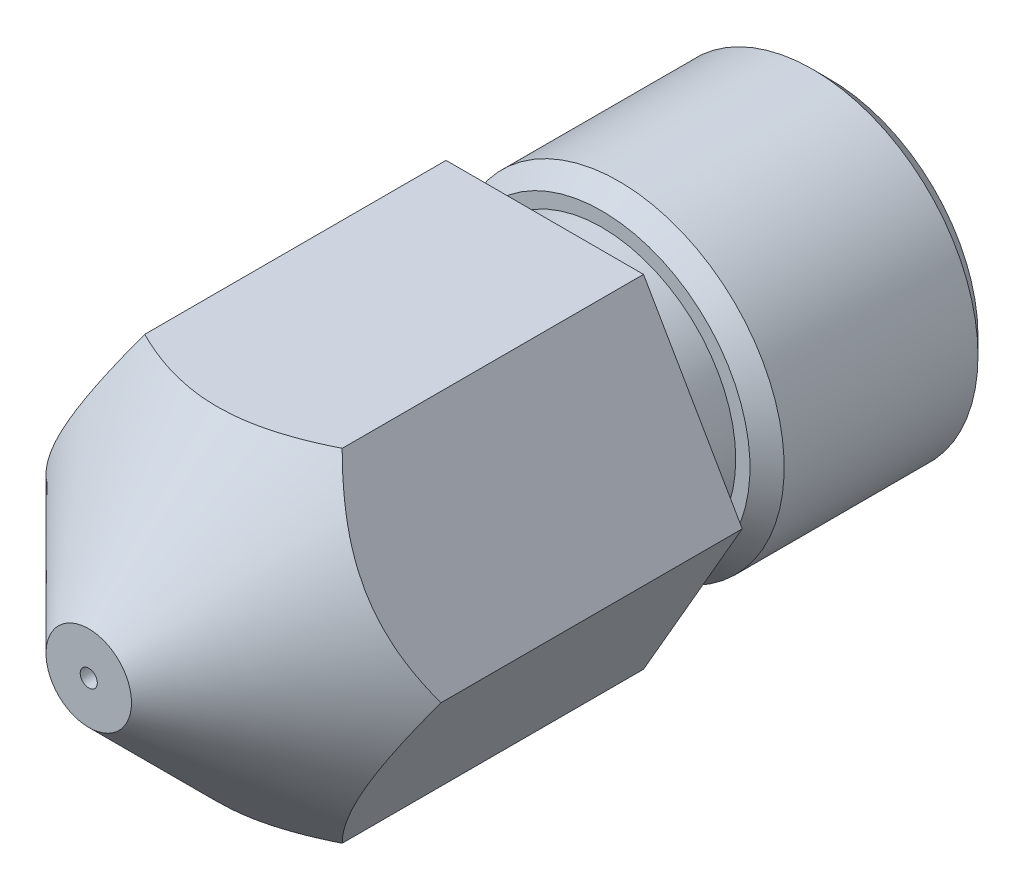
ISO-10303-21;
HEADER;
FILE_DESCRIPTION(('STEP AP214'),'2;1');
FILE_NAME('part.step','',(''),(''),'','','');
FILE_SCHEMA(('AUTOMOTIVE_DESIGN { 1 0 10303 214 1 1 1 1 }'));
ENDSEC;
DATA;
#1=APPLICATION_CONTEXT('core data for automotive mechanical design processes');
#2=APPLICATION_PROTOCOL_DEFINITION('international standard','automotive_design',2000,#1);
#3=PRODUCT_CONTEXT('',#1,'mechanical');
#4=PRODUCT('Part','Part','',(#3));
#5=PRODUCT_RELATED_PRODUCT_CATEGORY('part','',(#4));
#6=PRODUCT_DEFINITION_FORMATION('','',#4);
#7=PRODUCT_DEFINITION_CONTEXT('part definition',#1,'design');
#8=PRODUCT_DEFINITION('design','',#6,#7);
#9=PRODUCT_DEFINITION_SHAPE('','',#8);
#10=(LENGTH_UNIT() NAMED_UNIT(*) SI_UNIT(.MILLI.,.METRE.));
#11=(NAMED_UNIT(*) PLANE_ANGLE_UNIT() SI_UNIT($,.RADIAN.));
#12=(NAMED_UNIT(*) SI_UNIT($,.STERADIAN.) SOLID_ANGLE_UNIT());
#13=UNCERTAINTY_MEASURE_WITH_UNIT(LENGTH_MEASURE(1.E-05),#10,'distance_accuracy_value','');
#14=(GEOMETRIC_REPRESENTATION_CONTEXT(3) GLOBAL_UNCERTAINTY_ASSIGNED_CONTEXT((#13)) GLOBAL_UNIT_ASSIGNED_CONTEXT((#10,
#11,#12)) REPRESENTATION_CONTEXT('',''));
#15=CARTESIAN_POINT('',(0.,0.,0.));
#16=DIRECTION('',(0.,0.,1.));
#17=DIRECTION('',(1.,0.,0.));
#18=AXIS2_PLACEMENT_3D('',#15,#16,#17);
#19=CARTESIAN_POINT('',(0.,0.,5.));
#20=DIRECTION('',(0.,0.,-1.));
#21=DIRECTION('',(-1.,0.,0.));
#22=AXIS2_PLACEMENT_3D('',#19,#20,#21);
#23=CYLINDRICAL_SURFACE('',#22,2.35);
#24=CARTESIAN_POINT('',(0.,0.,5.));
#25=DIRECTION('',(0.,0.,-1.));
#26=DIRECTION('',(-1.,0.,0.));
#27=AXIS2_PLACEMENT_3D('',#24,#25,#26);
#28=CIRCLE('',#27,2.35);
#29=CARTESIAN_POINT('',(-2.35,0.,5.));
#30=VERTEX_POINT('',#29);
#31=EDGE_CURVE('E106',#30,#30,#28,.T.);
#32=ORIENTED_EDGE('',*,*,#31,.T.);
#33=EDGE_LOOP('',(#32));
#34=FACE_BOUND('',#33,.T.);
#35=CARTESIAN_POINT('',(0.,0.,4.));
#36=DIRECTION('',(0.,0.,-1.));
#37=DIRECTION('',(-1.,0.,0.));
#38=AXIS2_PLACEMENT_3D('',#35,#36,#37);
#39=CIRCLE('',#38,2.35);
#40=CARTESIAN_POINT('',(-2.35,0.,4.));
#41=VERTEX_POINT('',#40);
#42=EDGE_CURVE('E259',#41,#41,#39,.T.);
#43=ORIENTED_EDGE('',*,*,#42,.F.);
#44=EDGE_LOOP('',(#43));
#45=FACE_BOUND('',#44,.T.);
#46=ADVANCED_FACE('F36',(#34,#45),#23,.T.);
#47=CARTESIAN_POINT('',(1.73205080756888,-3.00000000000001,13.));
#48=DIRECTION('',(-0.866025403784438,0.5,0.));
#49=DIRECTION('',(-0.5,-0.866025403784439,0.));
#50=AXIS2_PLACEMENT_3D('',#47,#48,#49);
#51=PLANE('',#50);
#52=DIRECTION('',(-0.5,-0.866025403784439,0.));
#53=VECTOR('',#52,1.);
#54=CARTESIAN_POINT('',(1.73205080756888,-3.00000000000001,5.));
#55=LINE('',#54,#53);
#56=CARTESIAN_POINT('',(3.46410161513776,0.,5.));
#57=VERTEX_POINT('',#56);
#58=CARTESIAN_POINT('',(1.73205080756888,-3.00000000000001,5.));
#59=VERTEX_POINT('',#58);
#60=EDGE_CURVE('E51',#57,#59,#55,.T.);
#61=ORIENTED_EDGE('',*,*,#60,.F.);
#62=DIRECTION('',(0.,0.,-1.));
#63=VECTOR('',#62,1.);
#64=CARTESIAN_POINT('',(3.46410161513776,0.,13.));
#65=LINE('',#64,#63);
#66=CARTESIAN_POINT('',(3.46410161513776,0.,10.2858983848622));
#67=VERTEX_POINT('',#66);
#68=EDGE_CURVE('E96',#67,#57,#65,.T.);
#69=ORIENTED_EDGE('',*,*,#68,.F.);
#70=CARTESIAN_POINT('',(1.73193533751504,-3.00020000000001,10.2857829090351));
#71=CARTESIAN_POINT('',(1.79147372663452,-2.89707648504426,10.3452700665405));
#72=CARTESIAN_POINT('',(1.85200767512883,-2.79222861066936,10.4012634053967));
#73=CARTESIAN_POINT('',(1.97544301635334,-2.57843232821891,10.5037857884833));
#74=CARTESIAN_POINT('',(2.03835614749388,-2.46946358862025,10.550257791121));
#75=CARTESIAN_POINT('',(2.16521745390422,-2.24973336040298,10.6298651963459));
#76=CARTESIAN_POINT('',(2.22913332270057,-2.13902782823779,10.6632006842196));
#77=CARTESIAN_POINT('',(2.35837216363117,-1.91517958943468,10.7145608408829));
#78=CARTESIAN_POINT('',(2.42369118784644,-1.80204372079301,10.7326238473266));
#79=CARTESIAN_POINT('',(2.53626564359199,-1.6070590438073,10.7489214764118));
#80=CARTESIAN_POINT('',(2.58337569224233,-1.52546204599787,10.7513340176884));
#81=CARTESIAN_POINT('',(2.67751916315866,-1.36240077116991,10.7472689502051));
#82=CARTESIAN_POINT('',(2.7245525527757,-1.28093655070101,10.7407882248339));
#83=CARTESIAN_POINT('',(2.81817374583238,-1.11877988766163,10.719306662347));
#84=CARTESIAN_POINT('',(2.86476099147975,-1.0380884112157,10.704296294895));
#85=CARTESIAN_POINT('',(2.95713536549225,-0.878091302108665,10.6665747387962));
#86=CARTESIAN_POINT('',(3.00292255491615,-0.798785563690704,10.6438641405394));
#87=CARTESIAN_POINT('',(3.08420868340511,-0.657993859197246,10.5971377000083));
#88=CARTESIAN_POINT('',(3.11988753362892,-0.596196277853974,10.5743500571814));
#89=CARTESIAN_POINT('',(3.19060468282509,-0.47371058247978,10.5251020988048));
#90=CARTESIAN_POINT('',(3.2256429622163,-0.413022502364396,10.4986416711961));
#91=CARTESIAN_POINT('',(3.29496858432308,-0.292947002609137,10.4426413904709));
#92=CARTESIAN_POINT('',(3.32925789884291,-0.233556167704082,10.4131112203839));
#93=CARTESIAN_POINT('',(3.39720147685869,-0.115874438532732,10.3513592932867));
#94=CARTESIAN_POINT('',(3.43085611477447,-0.0575828957522659,10.3191391882029));
#95=CARTESIAN_POINT('',(3.4642170851916,0.000199999999999825,10.2857829090351));
#96=B_SPLINE_CURVE_WITH_KNOTS('',3,(#70,#71,#72,#73,#74,#75,#76,#77,#78,#79,#80,#81,#82,#83,#84,
#85,#86,#87,#88,#89,#90,#91,#92,#93,#94,#95),.UNSPECIFIED.,.F.,.F.,(4,2,2,2,2,2,2,2,2,2,2,2,4),
(0.,0.399603557139309,0.801535286397851,1.19708369162344,1.59163620080174,1.87398941755846,
2.15644160919094,2.43921001247427,2.72195674032139,2.94657516661928,3.17120044767276,
3.39513752837812,3.6189380838074),.UNSPECIFIED.);
#97=CARTESIAN_POINT('',(1.73205080756888,-3.00000000000001,10.2858983848622));
#98=VERTEX_POINT('',#97);
#99=EDGE_CURVE('E114',#98,#67,#96,.T.);
#100=ORIENTED_EDGE('',*,*,#99,.F.);
#101=DIRECTION('',(0.,0.,-1.));
#102=VECTOR('',#101,1.);
#103=CARTESIAN_POINT('',(1.73205080756888,-3.00000000000001,13.));
#104=LINE('',#103,#102);
#105=EDGE_CURVE('E110',#98,#59,#104,.T.);
#106=ORIENTED_EDGE('',*,*,#105,.T.);
#107=EDGE_LOOP('',(#61,#69,#100,#106));
#108=FACE_BOUND('',#107,.T.);
#109=ADVANCED_FACE('F155',(#108),#51,.F.);
#110=CARTESIAN_POINT('',(3.46410161513776,0.,13.));
#111=DIRECTION('',(-0.866025403784438,-0.5,0.));
#112=DIRECTION('',(0.5,-0.866025403784438,0.));
#113=AXIS2_PLACEMENT_3D('',#110,#111,#112);
#114=PLANE('',#113);
#115=DIRECTION('',(0.5,-0.866025403784438,0.));
#116=VECTOR('',#115,1.);
#117=CARTESIAN_POINT('',(3.46410161513776,0.,5.));
#118=LINE('',#117,#116);
#119=CARTESIAN_POINT('',(1.73205080756887,3.00000000000002,5.));
#120=VERTEX_POINT('',#119);
#121=EDGE_CURVE('E232',#120,#57,#118,.T.);
#122=ORIENTED_EDGE('',*,*,#121,.F.);
#123=DIRECTION('',(0.,0.,-1.));
#124=VECTOR('',#123,1.);
#125=CARTESIAN_POINT('',(1.73205080756887,3.00000000000002,13.));
#126=LINE('',#125,#124);
#127=CARTESIAN_POINT('',(1.73205080756887,3.00000000000002,10.2858983848622));
#128=VERTEX_POINT('',#127);
#129=EDGE_CURVE('E120',#128,#120,#126,.T.);
#130=ORIENTED_EDGE('',*,*,#129,.F.);
#131=CARTESIAN_POINT('',(3.4642170851916,-0.0002,10.2857829090351));
#132=CARTESIAN_POINT('',(3.40467869607212,0.102923514955748,10.3452700665405));
#133=CARTESIAN_POINT('',(3.34414474757781,0.20777138933065,10.4012634053967));
#134=CARTESIAN_POINT('',(3.2207094063533,0.421567671781097,10.5037857884833));
#135=CARTESIAN_POINT('',(3.15779627521276,0.530536411379761,10.550257791121));
#136=CARTESIAN_POINT('',(3.03093496880242,0.750266639597031,10.6298651963459));
#137=CARTESIAN_POINT('',(2.96701910000607,0.860972171762214,10.6632006842196));
#138=CARTESIAN_POINT('',(2.83778025907547,1.08482041056533,10.7145608408829));
#139=CARTESIAN_POINT('',(2.7724612348602,1.197956279207,10.7326238473266));
#140=CARTESIAN_POINT('',(2.65988677911465,1.39294095619271,10.7489214764118));
#141=CARTESIAN_POINT('',(2.6127767304643,1.47453795400214,10.7513340176884));
#142=CARTESIAN_POINT('',(2.51863325954798,1.63759922883009,10.7472689502051));
#143=CARTESIAN_POINT('',(2.47159986993094,1.71906344929899,10.7407882248339));
#144=CARTESIAN_POINT('',(2.37797867687426,1.88122011233838,10.719306662347));
#145=CARTESIAN_POINT('',(2.33139143122689,1.96191158878431,10.704296294895));
#146=CARTESIAN_POINT('',(2.23901705721438,2.12190869789134,10.6665747387962));
#147=CARTESIAN_POINT('',(2.19322986779049,2.2012144363093,10.6438641405394));
#148=CARTESIAN_POINT('',(2.11194373930153,2.34200614080276,10.5971377000083));
#149=CARTESIAN_POINT('',(2.07626488907772,2.40380372214604,10.5743500571814));
#150=CARTESIAN_POINT('',(2.00554773988155,2.52628941752023,10.5251020988048));
#151=CARTESIAN_POINT('',(1.97050946049033,2.58697749763562,10.498641671196));
#152=CARTESIAN_POINT('',(1.90118383838355,2.70705299739088,10.4426413904709));
#153=CARTESIAN_POINT('',(1.86689452386372,2.76644383229594,10.4131112203839));
#154=CARTESIAN_POINT('',(1.79895094584794,2.88412556146729,10.3513592932867));
#155=CARTESIAN_POINT('',(1.76529630793216,2.94241710424776,10.3191391882029));
#156=CARTESIAN_POINT('',(1.73193533751503,3.00020000000002,10.2857829090351));
#157=B_SPLINE_CURVE_WITH_KNOTS('',3,(#131,#132,#133,#134,#135,#136,#137,#138,#139,#140,#141,
#142,#143,#144,#145,#146,#147,#148,#149,#150,#151,#152,#153,#154,#155,#156),.UNSPECIFIED.,.F.,
.F.,(4,2,2,2,2,2,2,2,2,2,2,2,4),(0.,0.399603557139307,0.801535286397847,1.19708369162343,
1.59163620080173,1.87398941755845,2.15644160919093,2.43921001247426,2.72195674032139,
2.94657516661928,3.17120044767276,3.39513752837813,3.61893808380742),.UNSPECIFIED.);
#158=EDGE_CURVE('E213',#67,#128,#157,.T.);
#159=ORIENTED_EDGE('',*,*,#158,.F.);
#160=ORIENTED_EDGE('',*,*,#68,.T.);
#161=EDGE_LOOP('',(#122,#130,#159,#160));
#162=FACE_BOUND('',#161,.T.);
#163=ADVANCED_FACE('F161',(#162),#114,.F.);
#164=CARTESIAN_POINT('',(1.73205080756887,3.00000000000002,13.));
#165=DIRECTION('',(0.,-1.,0.));
#166=DIRECTION('',(0.,0.,-1.));
#167=AXIS2_PLACEMENT_3D('',#164,#165,#166);
#168=PLANE('',#167);
#169=DIRECTION('',(1.,0.,0.));
#170=VECTOR('',#169,1.);
#171=CARTESIAN_POINT('',(1.73205080756887,3.00000000000002,5.));
#172=LINE('',#171,#170);
#173=CARTESIAN_POINT('',(-1.73205080756888,3.00000000000002,5.));
#174=VERTEX_POINT('',#173);
#175=EDGE_CURVE('E235',#174,#120,#172,.T.);
#176=ORIENTED_EDGE('',*,*,#175,.F.);
#177=DIRECTION('',(0.,0.,-1.));
#178=VECTOR('',#177,1.);
#179=CARTESIAN_POINT('',(-1.73205080756888,3.00000000000002,13.));
#180=LINE('',#179,#178);
#181=CARTESIAN_POINT('',(-1.73205080756888,3.00000000000002,10.2858983848622));
#182=VERTEX_POINT('',#181);
#183=EDGE_CURVE('E112',#182,#174,#180,.T.);
#184=ORIENTED_EDGE('',*,*,#183,.F.);
#185=CARTESIAN_POINT('',(-10.8297485442238,3.00000000000002,2.5124089088846));
#186=CARTESIAN_POINT('',(-10.554255001337,3.00000000000002,2.77787972128063));
#187=CARTESIAN_POINT('',(-10.2784230341861,3.00000000000002,3.04300107978719));
#188=CARTESIAN_POINT('',(-9.7258325920714,3.00000000000002,3.57230971653583));
#189=CARTESIAN_POINT('',(-9.44907406205973,3.00000000000002,3.8364969372916));
#190=CARTESIAN_POINT('',(-8.89359643316114,3.00000000000002,4.36444710209984));
#191=CARTESIAN_POINT('',(-8.61487395960892,3.00000000000002,4.62820649859936));
#192=CARTESIAN_POINT('',(-8.05593967816077,3.00000000000002,5.15411793874028));
#193=CARTESIAN_POINT('',(-7.77572794094905,3.00000000000002,5.41627005741751));
#194=CARTESIAN_POINT('',(-7.178698325912,3.00000000000002,5.97054614237296));
#195=CARTESIAN_POINT('',(-6.86161890712889,3.00000000000002,6.26238874099486));
#196=CARTESIAN_POINT('',(-6.22381001221929,3.00000000000002,6.84217969394711));
#197=CARTESIAN_POINT('',(-5.90307997232285,3.00000000000002,7.13012743134141));
#198=CARTESIAN_POINT('',(-5.41818186961389,3.00000000000002,7.55718701315483));
#199=CARTESIAN_POINT('',(-5.2560533810813,3.00000000000002,7.69861287584137));
#200=CARTESIAN_POINT('',(-4.93008853106337,3.00000000000002,7.97948004218076));
#201=CARTESIAN_POINT('',(-4.76625220708876,3.00000000000002,8.11892138926286));
#202=CARTESIAN_POINT('',(-4.4364553305928,3.00000000000002,8.39518647476797));
#203=CARTESIAN_POINT('',(-4.27049534066076,3.00000000000002,8.53201088343815));
#204=CARTESIAN_POINT('',(-3.9357929900219,3.00000000000002,8.8022049280608));
#205=CARTESIAN_POINT('',(-3.76705086581556,3.00000000000002,8.93557485521509));
#206=CARTESIAN_POINT('',(-3.49824586120017,3.00000000000002,9.14198638611179));
#207=CARTESIAN_POINT('',(-3.39940876121794,3.00000000000002,9.21662339846001));
#208=CARTESIAN_POINT('',(-3.20029037669613,3.00000000000002,9.36395797092366));
#209=CARTESIAN_POINT('',(-3.10000904674469,3.00000000000002,9.4366554698478));
#210=CARTESIAN_POINT('',(-2.89758424783018,3.00000000000002,9.57976478384178));
#211=CARTESIAN_POINT('',(-2.79543807657385,3.00000000000002,9.65017278901778));
#212=CARTESIAN_POINT('',(-2.58912631607286,3.00000000000002,9.78797049570078));
#213=CARTESIAN_POINT('',(-2.48496080655522,3.00000000000002,9.85536031602468));
#214=CARTESIAN_POINT('',(-2.27613862552415,3.00000000000002,9.98513149775432));
#215=CARTESIAN_POINT('',(-2.17152470649404,3.00000000000002,10.0475812755354));
#216=CARTESIAN_POINT('',(-1.95957749878952,3.00000000000002,10.1677769743196));
#217=CARTESIAN_POINT('',(-1.85224363144994,3.00000000000002,10.225521883165));
#218=CARTESIAN_POINT('',(-1.63477381605771,3.00000000000002,10.3347885975086));
#219=CARTESIAN_POINT('',(-1.52464585932391,3.00000000000002,10.3863261580441));
#220=CARTESIAN_POINT('',(-1.30108726305077,3.00000000000002,10.4815725414289));
#221=CARTESIAN_POINT('',(-1.18765894719354,3.00000000000002,10.5252867245004));
#222=CARTESIAN_POINT('',(-0.980811658962299,3.00000000000002,10.594918873984));
#223=CARTESIAN_POINT('',(-0.888006801669923,3.00000000000002,10.6226480576432));
#224=CARTESIAN_POINT('',(-0.700458325163697,3.00000000000002,10.6706441632019));
#225=CARTESIAN_POINT('',(-0.605714742527311,3.00000000000002,10.6909112257507));
#226=CARTESIAN_POINT('',(-0.41529528385232,3.00000000000002,10.7228369617959));
#227=CARTESIAN_POINT('',(-0.319627282458229,3.00000000000002,10.7345418615844));
#228=CARTESIAN_POINT('',(-0.127606442156774,3.00000000000002,10.7488130596983));
#229=CARTESIAN_POINT('',(-0.0312536608819576,3.00000000000002,10.7513801181679));
#230=CARTESIAN_POINT('',(0.15895275580178,3.00000000000002,10.7472615358332));
#231=CARTESIAN_POINT('',(0.252811285760117,3.00000000000002,10.7407946860341));
#232=CARTESIAN_POINT('',(0.439547373352868,3.00000000000002,10.7193907048937));
#233=CARTESIAN_POINT('',(0.532424867801881,3.00000000000002,10.7044530313213));
#234=CARTESIAN_POINT('',(0.717111364718103,3.00000000000002,10.666816230935));
#235=CARTESIAN_POINT('',(0.80891148471331,3.00000000000002,10.6440741578579));
#236=CARTESIAN_POINT('',(0.990567448412205,3.00000000000002,10.591891644603));
#237=CARTESIAN_POINT('',(1.08042316309858,3.00000000000002,10.5624507614217));
#238=CARTESIAN_POINT('',(1.27162989432501,3.00000000000002,10.4930172631227));
#239=CARTESIAN_POINT('',(1.37264248392279,3.00000000000002,10.4521000206105));
#240=CARTESIAN_POINT('',(1.57202758706782,3.00000000000002,10.3642571236486));
#241=CARTESIAN_POINT('',(1.6703991954134,3.00000000000002,10.3173294401244));
#242=CARTESIAN_POINT('',(1.86487326297797,3.00000000000002,10.2186091490727));
#243=CARTESIAN_POINT('',(1.96097133622215,3.00000000000002,10.1668079675588));
#244=CARTESIAN_POINT('',(2.15097733592296,3.00000000000002,10.0593950954247));
#245=CARTESIAN_POINT('',(2.24488564330471,3.00000000000002,10.0037840742819));
#246=CARTESIAN_POINT('',(2.43204312152552,3.00000000000002,9.88874185394323));
#247=CARTESIAN_POINT('',(2.52526705470782,3.00000000000002,9.8292697876902));
#248=CARTESIAN_POINT('',(2.71004273833082,3.00000000000002,9.70778674722998));
#249=CARTESIAN_POINT('',(2.80159444303175,3.00000000000002,9.64577570372517));
#250=CARTESIAN_POINT('',(2.98316159349321,3.00000000000002,9.51975356320487));
#251=CARTESIAN_POINT('',(3.07317857826379,3.00000000000002,9.45574467729168));
#252=CARTESIAN_POINT('',(3.2519703453001,3.00000000000002,9.32602678136143));
#253=CARTESIAN_POINT('',(3.34074517510076,3.00000000000002,9.26031783667809));
#254=CARTESIAN_POINT('',(3.63631010806832,3.00000000000002,9.03788714348272));
#255=CARTESIAN_POINT('',(3.84071277943037,3.00000000000002,8.87799296098379));
#256=CARTESIAN_POINT('',(4.24536205671539,3.00000000000002,8.55301472303176));
#257=CARTESIAN_POINT('',(4.4456079883072,3.00000000000002,8.3879298362678));
#258=CARTESIAN_POINT('',(4.84311201861056,3.00000000000002,8.05402696552772));
#259=CARTESIAN_POINT('',(5.04036870580595,3.00000000000002,7.88520730519728));
#260=CARTESIAN_POINT('',(5.43256640459198,3.00000000000002,7.54489750781877));
#261=CARTESIAN_POINT('',(5.62750735649585,3.00000000000002,7.37340730220104));
#262=CARTESIAN_POINT('',(6.01602548386374,3.00000000000002,7.02804861909296));
#263=CARTESIAN_POINT('',(6.2095987863833,3.00000000000002,6.85417579154342));
#264=CARTESIAN_POINT('',(6.59533979089241,3.00000000000002,6.50487473650004));
#265=CARTESIAN_POINT('',(6.78750747293426,3.00000000000002,6.32944648701048));
#266=CARTESIAN_POINT('',(7.36223279304592,3.00000000000002,5.80145273009404));
#267=CARTESIAN_POINT('',(7.743126218278,3.00000000000002,5.44707654023067));
#268=CARTESIAN_POINT('',(8.4574939360397,3.00000000000002,4.77693402748768));
#269=CARTESIAN_POINT('',(8.79129232051,3.00000000000002,4.46151191740662));
#270=CARTESIAN_POINT('',(9.45724371903641,3.00000000000002,3.82887935215163));
#271=CARTESIAN_POINT('',(9.78939659045885,3.00000000000002,3.51166874687485));
#272=CARTESIAN_POINT('',(10.4511752285513,3.00000000000002,2.87717904452788));
#273=CARTESIAN_POINT('',(10.7808058006566,3.00000000000002,2.55990495384235));
#274=CARTESIAN_POINT('',(11.4390685849662,3.00000000000002,1.92438698279263));
#275=CARTESIAN_POINT('',(11.7677008918935,3.00000000000002,1.6061432005698));
#276=CARTESIAN_POINT('',(12.0959850288915,3.00000000000002,1.28754222397662));
#277=B_SPLINE_CURVE_WITH_KNOTS('',3,(#185,#186,#187,#188,#189,#190,#191,#192,#193,#194,#195,
#196,#197,#198,#199,#200,#201,#202,#203,#204,#205,#206,#207,#208,#209,#210,#211,#212,#213,#214,
#215,#216,#217,#218,#219,#220,#221,#222,#223,#224,#225,#226,#227,#228,#229,#230,#231,#232,#233,
#234,#235,#236,#237,#238,#239,#240,#241,#242,#243,#244,#245,#246,#247,#248,#249,#250,#251,#252,
#253,#254,#255,#256,#257,#258,#259,#260,#261,#262,#263,#264,#265,#266,#267,#268,#269,#270,#271,
#272,#273,#274,#275,#276),.UNSPECIFIED.,.F.,.F.,(4,2,2,2,2,2,2,2,2,2,2,2,2,2,2,2,2,2,2,2,2,2,2,
2,2,2,2,2,2,2,2,2,2,2,2,2,2,2,2,2,2,2,2,2,2,4),(0.,1.14775715410339,2.29558375231578,
3.44679461375312,4.59795131525612,5.89076048059842,7.18377208051808,7.82919233662477,
8.47459844652932,9.1198369802961,9.76502094430699,10.1365602695831,10.5081113030283,
10.8802519023127,11.2523778386369,11.6177913122069,11.9832831906984,12.3478269299939,
12.7121199362336,13.0024370688299,13.292748729124,13.5814812175134,13.8701896867257,
14.1520259189822,14.4338801940735,14.7173110185695,15.0007605922656,15.3274674453842,
15.6542848841509,15.9816884487522,16.309034627784,16.6407199446259,16.9724143203703,
17.3037537755725,17.6350805161659,18.4134693001945,19.1919833875399,19.9708543005205,
20.7497452450898,21.5303248291057,22.3109154692076,23.8716396168165,25.2493895260677,
26.6272568398787,27.9997970018826,29.3722025819775),.UNSPECIFIED.);
#278=EDGE_CURVE('E208',#128,#182,#277,.F.);
#279=ORIENTED_EDGE('',*,*,#278,.F.);
#280=ORIENTED_EDGE('',*,*,#129,.T.);
#281=EDGE_LOOP('',(#176,#184,#279,#280));
#282=FACE_BOUND('',#281,.T.);
#283=ADVANCED_FACE('F218',(#282),#168,.F.);
#284=CARTESIAN_POINT('',(-1.73205080756888,3.00000000000002,13.));
#285=DIRECTION('',(0.866025403784438,-0.500000000000001,0.));
#286=DIRECTION('',(0.500000000000001,0.866025403784438,0.));
#287=AXIS2_PLACEMENT_3D('',#284,#285,#286);
#288=PLANE('',#287);
#289=DIRECTION('',(0.500000000000001,0.866025403784438,0.));
#290=VECTOR('',#289,1.);
#291=CARTESIAN_POINT('',(-1.73205080756888,3.00000000000002,5.));
#292=LINE('',#291,#290);
#293=CARTESIAN_POINT('',(-3.46410161513777,0.,5.));
#294=VERTEX_POINT('',#293);
#295=EDGE_CURVE('E105',#294,#174,#292,.T.);
#296=ORIENTED_EDGE('',*,*,#295,.F.);
#297=DIRECTION('',(0.,0.,-1.));
#298=VECTOR('',#297,1.);
#299=CARTESIAN_POINT('',(-3.46410161513777,0.,13.));
#300=LINE('',#299,#298);
#301=CARTESIAN_POINT('',(-3.46410161513777,0.,10.2858983848622));
#302=VERTEX_POINT('',#301);
#303=EDGE_CURVE('E104',#302,#294,#300,.T.);
#304=ORIENTED_EDGE('',*,*,#303,.F.);
#305=CARTESIAN_POINT('',(-1.73193533751504,3.00020000000002,10.2857829090351));
#306=CARTESIAN_POINT('',(-1.79147372663452,2.89707648504427,10.3452700665404));
#307=CARTESIAN_POINT('',(-1.85200767512883,2.79222861066937,10.4012634053967));
#308=CARTESIAN_POINT('',(-1.97544301635334,2.57843232821892,10.5037857884833));
#309=CARTESIAN_POINT('',(-2.03835614749389,2.46946358862026,10.5502577911209));
#310=CARTESIAN_POINT('',(-2.16521745390423,2.24973336040299,10.6298651963459));
#311=CARTESIAN_POINT('',(-2.22913332270057,2.1390278282378,10.6632006842196));
#312=CARTESIAN_POINT('',(-2.35837216363118,1.91517958943469,10.7145608408829));
#313=CARTESIAN_POINT('',(-2.42369118784645,1.80204372079302,10.7326238473266));
#314=CARTESIAN_POINT('',(-2.536265643592,1.60705904380731,10.7489214764117));
#315=CARTESIAN_POINT('',(-2.58337569224234,1.52546204599787,10.7513340176884));
#316=CARTESIAN_POINT('',(-2.67751916315867,1.36240077116992,10.7472689502051));
#317=CARTESIAN_POINT('',(-2.72455255277571,1.28093655070102,10.7407882248339));
#318=CARTESIAN_POINT('',(-2.81817374583239,1.11877988766163,10.719306662347));
#319=CARTESIAN_POINT('',(-2.86476099147976,1.0380884112157,10.704296294895));
#320=CARTESIAN_POINT('',(-2.95713536549226,0.878091302108668,10.6665747387962));
#321=CARTESIAN_POINT('',(-3.00292255491616,0.798785563690707,10.6438641405394));
#322=CARTESIAN_POINT('',(-3.08420868340512,0.657993859197249,10.5971377000083));
#323=CARTESIAN_POINT('',(-3.11988753362893,0.596196277853977,10.5743500571814));
#324=CARTESIAN_POINT('',(-3.1906046828251,0.473710582479783,10.5251020988048));
#325=CARTESIAN_POINT('',(-3.22564296221631,0.413022502364399,10.498641671196));
#326=CARTESIAN_POINT('',(-3.29496858432309,0.29294700260914,10.4426413904709));
#327=CARTESIAN_POINT('',(-3.32925789884292,0.233556167704085,10.4131112203839));
#328=CARTESIAN_POINT('',(-3.3972014768587,0.115874438532735,10.3513592932867));
#329=CARTESIAN_POINT('',(-3.43085611477448,0.0575828957522694,10.3191391882029));
#330=CARTESIAN_POINT('',(-3.46421708519161,-0.00019999999999616,10.2857829090351));
#331=B_SPLINE_CURVE_WITH_KNOTS('',3,(#305,#306,#307,#308,#309,#310,#311,#312,#313,#314,#315,
#316,#317,#318,#319,#320,#321,#322,#323,#324,#325,#326,#327,#328,#329,#330),.UNSPECIFIED.,.F.,
.F.,(4,2,2,2,2,2,2,2,2,2,2,2,4),(0.,0.399603557139311,0.801535286397856,1.19708369162344,
1.59163620080175,1.87398941755846,2.15644160919095,2.43921001247428,2.72195674032141,
2.94657516661929,3.17120044767277,3.39513752837813,3.61893808380742),.UNSPECIFIED.);
#332=EDGE_CURVE('E202',#182,#302,#331,.T.);
#333=ORIENTED_EDGE('',*,*,#332,.F.);
#334=ORIENTED_EDGE('',*,*,#183,.T.);
#335=EDGE_LOOP('',(#296,#304,#333,#334));
#336=FACE_BOUND('',#335,.T.);
#337=ADVANCED_FACE('F221',(#336),#288,.F.);
#338=CARTESIAN_POINT('',(-3.46410161513777,0.,13.));
#339=DIRECTION('',(0.866025403784439,0.5,0.));
#340=DIRECTION('',(-0.5,0.866025403784439,0.));
#341=AXIS2_PLACEMENT_3D('',#338,#339,#340);
#342=PLANE('',#341);
#343=DIRECTION('',(-0.5,0.866025403784439,0.));
#344=VECTOR('',#343,1.);
#345=CARTESIAN_POINT('',(-3.46410161513777,0.,5.));
#346=LINE('',#345,#344);
#347=CARTESIAN_POINT('',(-1.73205080756889,-3.00000000000001,5.));
#348=VERTEX_POINT('',#347);
#349=EDGE_CURVE('E89',#348,#294,#346,.T.);
#350=ORIENTED_EDGE('',*,*,#349,.F.);
#351=DIRECTION('',(0.,0.,-1.));
#352=VECTOR('',#351,1.);
#353=CARTESIAN_POINT('',(-1.73205080756889,-3.00000000000001,13.));
#354=LINE('',#353,#352);
#355=CARTESIAN_POINT('',(-1.73205080756889,-3.00000000000001,10.2858983848622));
#356=VERTEX_POINT('',#355);
#357=EDGE_CURVE('E102',#356,#348,#354,.T.);
#358=ORIENTED_EDGE('',*,*,#357,.F.);
#359=CARTESIAN_POINT('',(-3.46421708519161,0.000200000000003469,10.2857829090351));
#360=CARTESIAN_POINT('',(-3.40467869607213,-0.102923514955745,10.3452700665405));
#361=CARTESIAN_POINT('',(-3.34414474757782,-0.207771389330648,10.4012634053967));
#362=CARTESIAN_POINT('',(-3.22070940635331,-0.421567671781095,10.5037857884833));
#363=CARTESIAN_POINT('',(-3.15779627521277,-0.530536411379759,10.5502577911209));
#364=CARTESIAN_POINT('',(-3.03093496880243,-0.750266639597029,10.6298651963459));
#365=CARTESIAN_POINT('',(-2.96701910000608,-0.860972171762213,10.6632006842196));
#366=CARTESIAN_POINT('',(-2.83778025907548,-1.08482041056533,10.7145608408829));
#367=CARTESIAN_POINT('',(-2.77246123486021,-1.197956279207,10.7326238473266));
#368=CARTESIAN_POINT('',(-2.65988677911466,-1.39294095619271,10.7489214764117));
#369=CARTESIAN_POINT('',(-2.61277673046432,-1.47453795400214,10.7513340176884));
#370=CARTESIAN_POINT('',(-2.51863325954799,-1.63759922883009,10.7472689502051));
#371=CARTESIAN_POINT('',(-2.47159986993095,-1.71906344929899,10.7407882248339));
#372=CARTESIAN_POINT('',(-2.37797867687427,-1.88122011233838,10.719306662347));
#373=CARTESIAN_POINT('',(-2.3313914312269,-1.96191158878431,10.704296294895));
#374=CARTESIAN_POINT('',(-2.2390170572144,-2.12190869789134,10.6665747387962));
#375=CARTESIAN_POINT('',(-2.1932298677905,-2.2012144363093,10.6438641405394));
#376=CARTESIAN_POINT('',(-2.11194373930154,-2.34200614080276,10.5971377000083));
#377=CARTESIAN_POINT('',(-2.07626488907773,-2.40380372214604,10.5743500571814));
#378=CARTESIAN_POINT('',(-2.00554773988156,-2.52628941752023,10.5251020988048));
#379=CARTESIAN_POINT('',(-1.97050946049034,-2.58697749763561,10.498641671196));
#380=CARTESIAN_POINT('',(-1.90118383838357,-2.70705299739087,10.4426413904709));
#381=CARTESIAN_POINT('',(-1.86689452386374,-2.76644383229593,10.4131112203839));
#382=CARTESIAN_POINT('',(-1.79895094584796,-2.88412556146728,10.3513592932867));
#383=CARTESIAN_POINT('',(-1.76529630793217,-2.94241710424775,10.3191391882029));
#384=CARTESIAN_POINT('',(-1.73193533751505,-3.00020000000001,10.2857829090351));
#385=B_SPLINE_CURVE_WITH_KNOTS('',3,(#359,#360,#361,#362,#363,#364,#365,#366,#367,#368,#369,
#370,#371,#372,#373,#374,#375,#376,#377,#378,#379,#380,#381,#382,#383,#384),.UNSPECIFIED.,.F.,
.F.,(4,2,2,2,2,2,2,2,2,2,2,2,4),(0.,0.399603557139309,0.801535286397849,1.19708369162343,
1.59163620080174,1.87398941755845,2.15644160919094,2.43921001247426,2.72195674032139,
2.94657516661928,3.17120044767276,3.39513752837812,3.61893808380741),.UNSPECIFIED.);
#386=EDGE_CURVE('E59',#302,#356,#385,.T.);
#387=ORIENTED_EDGE('',*,*,#386,.F.);
#388=ORIENTED_EDGE('',*,*,#303,.T.);
#389=EDGE_LOOP('',(#350,#358,#387,#388));
#390=FACE_BOUND('',#389,.T.);
#391=ADVANCED_FACE('F101',(#390),#342,.F.);
#392=CARTESIAN_POINT('',(-1.73205080756889,-3.00000000000001,13.));
#393=DIRECTION('',(0.,1.,0.));
#394=DIRECTION('',(-1.,0.,0.));
#395=AXIS2_PLACEMENT_3D('',#392,#393,#394);
#396=PLANE('',#395);
#397=DIRECTION('',(-1.,0.,0.));
#398=VECTOR('',#397,1.);
#399=CARTESIAN_POINT('',(-1.73205080756889,-3.00000000000001,5.));
#400=LINE('',#399,#398);
#401=EDGE_CURVE('E86',#59,#348,#400,.T.);
#402=ORIENTED_EDGE('',*,*,#401,.F.);
#403=ORIENTED_EDGE('',*,*,#105,.F.);
#404=CARTESIAN_POINT('',(-10.8297485442239,-3.00000000000002,2.51240890888451));
#405=CARTESIAN_POINT('',(-10.5542550013371,-3.00000000000002,2.77787972128054));
#406=CARTESIAN_POINT('',(-10.2784230341862,-3.00000000000002,3.0430010797871));
#407=CARTESIAN_POINT('',(-9.72583259207148,-3.00000000000002,3.57230971653575));
#408=CARTESIAN_POINT('',(-9.44907406205981,-3.00000000000002,3.83649693729153));
#409=CARTESIAN_POINT('',(-8.8935964331612,-3.00000000000002,4.36444710209978));
#410=CARTESIAN_POINT('',(-8.61487395960899,-3.00000000000002,4.6282064985993));
#411=CARTESIAN_POINT('',(-8.05593967816083,-3.00000000000002,5.15411793874023));
#412=CARTESIAN_POINT('',(-7.77572794094911,-3.00000000000002,5.41627005741746));
#413=CARTESIAN_POINT('',(-7.17869832591204,-3.00000000000002,5.97054614237293));
#414=CARTESIAN_POINT('',(-6.86161890712893,-3.00000000000002,6.26238874099483));
#415=CARTESIAN_POINT('',(-6.22381001221932,-3.00000000000002,6.84217969394709));
#416=CARTESIAN_POINT('',(-5.90307997232287,-3.00000000000001,7.13012743134139));
#417=CARTESIAN_POINT('',(-5.4181818696139,-3.00000000000001,7.55718701315482));
#418=CARTESIAN_POINT('',(-5.25605338108131,-3.00000000000001,7.69861287584137));
#419=CARTESIAN_POINT('',(-4.93008853106337,-3.00000000000001,7.97948004218077));
#420=CARTESIAN_POINT('',(-4.76625220708875,-3.00000000000001,8.11892138926287));
#421=CARTESIAN_POINT('',(-4.43645533059279,-3.00000000000001,8.39518647476798));
#422=CARTESIAN_POINT('',(-4.27049534066075,-3.00000000000001,8.53201088343817));
#423=CARTESIAN_POINT('',(-3.93579299002188,-3.00000000000001,8.80220492806082));
#424=CARTESIAN_POINT('',(-3.76705086581554,-3.00000000000001,8.93557485521511));
#425=CARTESIAN_POINT('',(-3.49824586120015,-3.00000000000001,9.14198638611181));
#426=CARTESIAN_POINT('',(-3.39940876121792,-3.00000000000001,9.21662339846004));
#427=CARTESIAN_POINT('',(-3.20029037669611,-3.00000000000001,9.36395797092368));
#428=CARTESIAN_POINT('',(-3.10000904674467,-3.00000000000001,9.43665546984782));
#429=CARTESIAN_POINT('',(-2.89758424783016,-3.00000000000001,9.5797647838418));
#430=CARTESIAN_POINT('',(-2.79543807657384,-3.00000000000001,9.6501727890178));
#431=CARTESIAN_POINT('',(-2.58912631607285,-3.00000000000001,9.7879704957008));
#432=CARTESIAN_POINT('',(-2.48496080655521,-3.00000000000001,9.85536031602469));
#433=CARTESIAN_POINT('',(-2.27613862552415,-3.00000000000001,9.98513149775434));
#434=CARTESIAN_POINT('',(-2.17152470649404,-3.00000000000001,10.0475812755354));
#435=CARTESIAN_POINT('',(-1.95957749878952,-3.00000000000001,10.1677769743196));
#436=CARTESIAN_POINT('',(-1.85224363144994,-3.00000000000001,10.225521883165));
#437=CARTESIAN_POINT('',(-1.63477381605771,-3.00000000000001,10.3347885975086));
#438=CARTESIAN_POINT('',(-1.52464585932392,-3.00000000000001,10.3863261580442));
#439=CARTESIAN_POINT('',(-1.30108726305078,-3.00000000000001,10.4815725414289));
#440=CARTESIAN_POINT('',(-1.18765894719355,-3.00000000000001,10.5252867245004));
#441=CARTESIAN_POINT('',(-0.980811658962307,-3.00000000000001,10.594918873984));
#442=CARTESIAN_POINT('',(-0.888006801669931,-3.00000000000001,10.6226480576432));
#443=CARTESIAN_POINT('',(-0.700458325163705,-3.00000000000001,10.6706441632019));
#444=CARTESIAN_POINT('',(-0.605714742527318,-3.00000000000001,10.6909112257507));
#445=CARTESIAN_POINT('',(-0.415295283852327,-3.00000000000001,10.7228369617959));
#446=CARTESIAN_POINT('',(-0.319627282458236,-3.00000000000001,10.7345418615844));
#447=CARTESIAN_POINT('',(-0.12760644215678,-3.00000000000001,10.7488130596983));
#448=CARTESIAN_POINT('',(-0.0312536608819641,-3.00000000000001,10.7513801181679));
#449=CARTESIAN_POINT('',(0.158952755801774,-3.00000000000001,10.7472615358332));
#450=CARTESIAN_POINT('',(0.25281128576011,-3.00000000000001,10.7407946860341));
#451=CARTESIAN_POINT('',(0.439547373352862,-3.00000000000001,10.7193907048937));
#452=CARTESIAN_POINT('',(0.532424867801875,-3.00000000000001,10.7044530313213));
#453=CARTESIAN_POINT('',(0.717111364718096,-3.00000000000001,10.666816230935));
#454=CARTESIAN_POINT('',(0.808911484713303,-3.00000000000001,10.6440741578579));
#455=CARTESIAN_POINT('',(0.990567448412198,-3.00000000000001,10.591891644603));
#456=CARTESIAN_POINT('',(1.08042316309858,-3.00000000000001,10.5624507614217));
#457=CARTESIAN_POINT('',(1.271629894325,-3.00000000000001,10.4930172631227));
#458=CARTESIAN_POINT('',(1.37264248392278,-3.00000000000001,10.4521000206105));
#459=CARTESIAN_POINT('',(1.57202758706781,-3.00000000000001,10.3642571236486));
#460=CARTESIAN_POINT('',(1.67039919541339,-3.00000000000001,10.3173294401244));
#461=CARTESIAN_POINT('',(1.86487326297796,-3.00000000000001,10.2186091490727));
#462=CARTESIAN_POINT('',(1.96097133622214,-3.00000000000001,10.1668079675588));
#463=CARTESIAN_POINT('',(2.15097733592294,-3.00000000000001,10.0593950954248));
#464=CARTESIAN_POINT('',(2.24488564330469,-3.00000000000001,10.003784074282));
#465=CARTESIAN_POINT('',(2.43204312152551,-3.00000000000001,9.88874185394325));
#466=CARTESIAN_POINT('',(2.5252670547078,-3.00000000000001,9.82926978769022));
#467=CARTESIAN_POINT('',(2.71004273833079,-3.00000000000001,9.70778674723001));
#468=CARTESIAN_POINT('',(2.80159444303173,-3.00000000000001,9.64577570372519));
#469=CARTESIAN_POINT('',(2.98316159349318,-3.00000000000001,9.51975356320489));
#470=CARTESIAN_POINT('',(3.07317857826377,-3.00000000000001,9.45574467729171));
#471=CARTESIAN_POINT('',(3.25197034530008,-3.00000000000001,9.32602678136146));
#472=CARTESIAN_POINT('',(3.34074517510074,-3.00000000000001,9.26031783667812));
#473=CARTESIAN_POINT('',(3.63631010806829,-3.00000000000001,9.03788714348276));
#474=CARTESIAN_POINT('',(3.84071277943034,-3.00000000000001,8.87799296098382));
#475=CARTESIAN_POINT('',(4.24536205671535,-3.00000000000001,8.5530147230318));
#476=CARTESIAN_POINT('',(4.44560798830716,-3.00000000000001,8.38792983626784));
#477=CARTESIAN_POINT('',(4.84311201861052,-3.00000000000001,8.05402696552776));
#478=CARTESIAN_POINT('',(5.04036870580591,-3.00000000000001,7.88520730519732));
#479=CARTESIAN_POINT('',(5.43256640459193,-3.00000000000001,7.54489750781882));
#480=CARTESIAN_POINT('',(5.62750735649579,-3.00000000000001,7.37340730220109));
#481=CARTESIAN_POINT('',(6.01602548386368,-3.00000000000001,7.02804861909301));
#482=CARTESIAN_POINT('',(6.20959878638325,-3.00000000000001,6.85417579154348));
#483=CARTESIAN_POINT('',(6.59533979089234,-3.00000000000001,6.50487473650011));
#484=CARTESIAN_POINT('',(6.7875074729342,-3.00000000000001,6.32944648701055));
#485=CARTESIAN_POINT('',(7.36223279304585,-3.00000000000001,5.80145273009411));
#486=CARTESIAN_POINT('',(7.74312621827792,-3.00000000000001,5.44707654023074));
#487=CARTESIAN_POINT('',(8.45749393603962,-3.00000000000001,4.77693402748776));
#488=CARTESIAN_POINT('',(8.79129232050992,-3.00000000000001,4.4615119174067));
#489=CARTESIAN_POINT('',(9.45724371903631,-3.00000000000001,3.82887935215172));
#490=CARTESIAN_POINT('',(9.78939659045875,-3.00000000000001,3.51166874687494));
#491=CARTESIAN_POINT('',(10.4511752285512,-3.00000000000001,2.87717904452798));
#492=CARTESIAN_POINT('',(10.7808058006565,-3.00000000000001,2.55990495384245));
#493=CARTESIAN_POINT('',(11.4390685849661,-3.00000000000001,1.92438698279274));
#494=CARTESIAN_POINT('',(11.7677008918934,-3.00000000000001,1.60614320056992));
#495=CARTESIAN_POINT('',(12.0959850288913,-3.00000000000001,1.28754222397673));
#496=B_SPLINE_CURVE_WITH_KNOTS('',3,(#404,#405,#406,#407,#408,#409,#410,#411,#412,#413,#414,
#415,#416,#417,#418,#419,#420,#421,#422,#423,#424,#425,#426,#427,#428,#429,#430,#431,#432,#433,
#434,#435,#436,#437,#438,#439,#440,#441,#442,#443,#444,#445,#446,#447,#448,#449,#450,#451,#452,
#453,#454,#455,#456,#457,#458,#459,#460,#461,#462,#463,#464,#465,#466,#467,#468,#469,#470,#471,
#472,#473,#474,#475,#476,#477,#478,#479,#480,#481,#482,#483,#484,#485,#486,#487,#488,#489,#490,
#491,#492,#493,#494,#495),.UNSPECIFIED.,.F.,.F.,(4,2,2,2,2,2,2,2,2,2,2,2,2,2,2,2,2,2,2,2,2,2,2,
2,2,2,2,2,2,2,2,2,2,2,2,2,2,2,2,2,2,2,2,2,2,4),(0.,1.14775715410341,2.29558375231582,
3.44679461375318,4.5979513152562,5.89076048059852,7.1837720805182,7.82919233662491,
8.47459844652947,9.11983698029627,9.76502094430716,10.1365602695833,10.5081113030285,
10.8802519023129,11.252377838637,11.6177913122071,11.9832831906985,12.347826929994,
12.7121199362337,13.0024370688301,13.2927487291242,13.5814812175135,13.8701896867258,
14.1520259189824,14.4338801940737,14.7173110185697,15.0007605922657,15.3274674453844,
15.6542848841511,15.9816884487523,16.3090346277841,16.640719944626,16.9724143203704,
17.3037537755726,17.635080516166,18.4134693001946,19.19198338754,19.9708543005206,
20.7497452450898,21.5303248291057,22.3109154692077,23.8716396168166,25.2493895260677,
26.6272568398787,27.9997970018826,29.3722025819775),.UNSPECIFIED.);
#497=EDGE_CURVE('E109',#356,#98,#496,.T.);
#498=ORIENTED_EDGE('',*,*,#497,.F.);
#499=ORIENTED_EDGE('',*,*,#357,.T.);
#500=EDGE_LOOP('',(#402,#403,#498,#499));
#501=FACE_BOUND('',#500,.T.);
#502=ADVANCED_FACE('F108',(#501),#396,.F.);
#503=CARTESIAN_POINT('',(0.,0.,13.));
#504=DIRECTION('',(0.,0.,-1.));
#505=DIRECTION('',(1.,0.,0.));
#506=AXIS2_PLACEMENT_3D('',#503,#504,#505);
#507=CONICAL_SURFACE('',#506,0.750000000000001,0.78539816339745);
#508=CARTESIAN_POINT('',(0.,0.,13.));
#509=DIRECTION('',(0.,0.,1.));
#510=DIRECTION('',(1.,0.,0.));
#511=AXIS2_PLACEMENT_3D('',#508,#509,#510);
#512=CIRCLE('',#511,0.750000000000001);
#513=CARTESIAN_POINT('',(0.750000000000001,0.,13.));
#514=VERTEX_POINT('',#513);
#515=EDGE_CURVE('E242',#514,#514,#512,.T.);
#516=ORIENTED_EDGE('',*,*,#515,.F.);
#517=EDGE_LOOP('',(#516));
#518=FACE_BOUND('',#517,.T.);
#519=ORIENTED_EDGE('',*,*,#99,.T.);
#520=ORIENTED_EDGE('',*,*,#158,.T.);
#521=ORIENTED_EDGE('',*,*,#278,.T.);
#522=ORIENTED_EDGE('',*,*,#332,.T.);
#523=ORIENTED_EDGE('',*,*,#386,.T.);
#524=ORIENTED_EDGE('',*,*,#497,.T.);
#525=EDGE_LOOP('',(#519,#520,#521,#522,#523,#524));
#526=FACE_BOUND('',#525,.T.);
#527=ADVANCED_FACE('F175',(#518,#526),#507,.T.);
#528=CARTESIAN_POINT('',(0.,0.,13.));
#529=DIRECTION('',(0.,0.,1.));
#530=DIRECTION('',(1.,0.,0.));
#531=AXIS2_PLACEMENT_3D('',#528,#529,#530);
#532=PLANE('',#531);
#533=CARTESIAN_POINT('',(0.,0.,13.));
#534=DIRECTION('',(0.,0.,1.));
#535=DIRECTION('',(1.,0.,0.));
#536=AXIS2_PLACEMENT_3D('',#533,#534,#535);
#537=CIRCLE('',#536,0.15);
#538=CARTESIAN_POINT('',(0.15,0.,13.));
#539=VERTEX_POINT('',#538);
#540=EDGE_CURVE('E256',#539,#539,#537,.T.);
#541=ORIENTED_EDGE('',*,*,#540,.F.);
#542=EDGE_LOOP('',(#541));
#543=FACE_BOUND('',#542,.T.);
#544=ORIENTED_EDGE('',*,*,#515,.T.);
#545=EDGE_LOOP('',(#544));
#546=FACE_BOUND('',#545,.T.);
#547=ADVANCED_FACE('F173',(#543,#546),#532,.T.);
#548=CARTESIAN_POINT('',(0.,0.,5.));
#549=DIRECTION('',(0.,0.,-1.));
#550=DIRECTION('',(-1.,0.,0.));
#551=AXIS2_PLACEMENT_3D('',#548,#549,#550);
#552=PLANE('',#551);
#553=ORIENTED_EDGE('',*,*,#31,.F.);
#554=EDGE_LOOP('',(#553));
#555=FACE_BOUND('',#554,.T.);
#556=ORIENTED_EDGE('',*,*,#60,.T.);
#557=ORIENTED_EDGE('',*,*,#401,.T.);
#558=ORIENTED_EDGE('',*,*,#349,.T.);
#559=ORIENTED_EDGE('',*,*,#295,.T.);
#560=ORIENTED_EDGE('',*,*,#175,.T.);
#561=ORIENTED_EDGE('',*,*,#121,.T.);
#562=EDGE_LOOP('',(#556,#557,#558,#559,#560,#561));
#563=FACE_BOUND('',#562,.T.);
#564=ADVANCED_FACE('F88',(#555,#563),#552,.T.);
#565=CARTESIAN_POINT('',(0.,0.,0.));
#566=DIRECTION('',(0.,0.,1.));
#567=DIRECTION('',(1.,0.,0.));
#568=AXIS2_PLACEMENT_3D('',#565,#566,#567);
#569=PLANE('',#568);
#570=CARTESIAN_POINT('',(0.,0.,0.));
#571=DIRECTION('',(0.,0.,1.));
#572=DIRECTION('',(1.,0.,0.));
#573=AXIS2_PLACEMENT_3D('',#570,#571,#572);
#574=CIRCLE('',#573,1.3);
#575=CARTESIAN_POINT('',(1.3,0.,0.));
#576=VERTEX_POINT('',#575);
#577=EDGE_CURVE('E130',#576,#576,#574,.T.);
#578=ORIENTED_EDGE('',*,*,#577,.T.);
#579=EDGE_LOOP('',(#578));
#580=FACE_BOUND('',#579,.T.);
#581=CARTESIAN_POINT('',(0.,0.,0.));
#582=DIRECTION('',(0.,0.,1.));
#583=DIRECTION('',(1.,0.,0.));
#584=AXIS2_PLACEMENT_3D('',#581,#582,#583);
#585=CIRCLE('',#584,2.6);
#586=CARTESIAN_POINT('',(2.6,0.,0.));
#587=VERTEX_POINT('',#586);
#588=EDGE_CURVE('E127',#587,#587,#585,.F.);
#589=ORIENTED_EDGE('',*,*,#588,.T.);
#590=EDGE_LOOP('',(#589));
#591=FACE_BOUND('',#590,.T.);
#592=ADVANCED_FACE('F172',(#580,#591),#569,.F.);
#593=CARTESIAN_POINT('',(0.,0.,12.));
#594=DIRECTION('',(0.,0.,-1.));
#595=DIRECTION('',(-1.,0.,0.));
#596=AXIS2_PLACEMENT_3D('',#593,#594,#595);
#597=CYLINDRICAL_SURFACE('',#596,1.);
#598=CARTESIAN_POINT('',(0.,0.,0.300000000000002));
#599=DIRECTION('',(0.,0.,1.));
#600=DIRECTION('',(1.,0.,0.));
#601=AXIS2_PLACEMENT_3D('',#598,#599,#600);
#602=CIRCLE('',#601,1.);
#603=CARTESIAN_POINT('',(1.,0.,0.300000000000002));
#604=VERTEX_POINT('',#603);
#605=EDGE_CURVE('E95',#604,#604,#602,.F.);
#606=ORIENTED_EDGE('',*,*,#605,.T.);
#607=EDGE_LOOP('',(#606));
#608=FACE_BOUND('',#607,.T.);
#609=CARTESIAN_POINT('',(0.,0.,12.));
#610=DIRECTION('',(0.,0.,-1.));
#611=DIRECTION('',(-1.,0.,0.));
#612=AXIS2_PLACEMENT_3D('',#609,#610,#611);
#613=CIRCLE('',#612,1.);
#614=CARTESIAN_POINT('',(-1.,0.,12.));
#615=VERTEX_POINT('',#614);
#616=EDGE_CURVE('E252',#615,#615,#613,.T.);
#617=ORIENTED_EDGE('',*,*,#616,.F.);
#618=EDGE_LOOP('',(#617));
#619=FACE_BOUND('',#618,.T.);
#620=ADVANCED_FACE('F168',(#608,#619),#597,.F.);
#621=CARTESIAN_POINT('',(0.,0.,12.));
#622=DIRECTION('',(0.,0.,-1.));
#623=DIRECTION('',(-1.,0.,0.));
#624=AXIS2_PLACEMENT_3D('',#621,#622,#623);
#625=PLANE('',#624);
#626=CARTESIAN_POINT('',(0.,0.,12.));
#627=DIRECTION('',(0.,0.,1.));
#628=DIRECTION('',(1.,0.,0.));
#629=AXIS2_PLACEMENT_3D('',#626,#627,#628);
#630=CIRCLE('',#629,0.15);
#631=CARTESIAN_POINT('',(0.15,0.,12.));
#632=VERTEX_POINT('',#631);
#633=EDGE_CURVE('E255',#632,#632,#630,.T.);
#634=ORIENTED_EDGE('',*,*,#633,.T.);
#635=EDGE_LOOP('',(#634));
#636=FACE_BOUND('',#635,.T.);
#637=ORIENTED_EDGE('',*,*,#616,.T.);
#638=EDGE_LOOP('',(#637));
#639=FACE_BOUND('',#638,.T.);
#640=ADVANCED_FACE('F275',(#636,#639),#625,.T.);
#641=CARTESIAN_POINT('',(0.,0.,12.));
#642=DIRECTION('',(0.,0.,1.));
#643=DIRECTION('',(1.,0.,0.));
#644=AXIS2_PLACEMENT_3D('',#641,#642,#643);
#645=CYLINDRICAL_SURFACE('',#644,0.15);
#646=ORIENTED_EDGE('',*,*,#633,.F.);
#647=EDGE_LOOP('',(#646));
#648=FACE_BOUND('',#647,.T.);
#649=ORIENTED_EDGE('',*,*,#540,.T.);
#650=EDGE_LOOP('',(#649));
#651=FACE_BOUND('',#650,.T.);
#652=ADVANCED_FACE('F271',(#648,#651),#645,.F.);
#653=CARTESIAN_POINT('',(0.,0.,4.));
#654=DIRECTION('',(0.,0.,-1.));
#655=DIRECTION('',(-1.,0.,0.));
#656=AXIS2_PLACEMENT_3D('',#653,#654,#655);
#657=CYLINDRICAL_SURFACE('',#656,2.9);
#658=CARTESIAN_POINT('',(0.,0.,3.7));
#659=DIRECTION('',(0.,0.,-1.));
#660=DIRECTION('',(-1.,0.,0.));
#661=AXIS2_PLACEMENT_3D('',#658,#659,#660);
#662=CIRCLE('',#661,2.9);
#663=CARTESIAN_POINT('',(-2.9,0.,3.7));
#664=VERTEX_POINT('',#663);
#665=EDGE_CURVE('E44',#664,#664,#662,.T.);
#666=ORIENTED_EDGE('',*,*,#665,.T.);
#667=EDGE_LOOP('',(#666));
#668=FACE_BOUND('',#667,.T.);
#669=CARTESIAN_POINT('',(0.,0.,0.300000000000001));
#670=DIRECTION('',(0.,0.,1.));
#671=DIRECTION('',(1.,0.,0.));
#672=AXIS2_PLACEMENT_3D('',#669,#670,#671);
#673=CIRCLE('',#672,2.9);
#674=CARTESIAN_POINT('',(2.9,0.,0.300000000000001));
#675=VERTEX_POINT('',#674);
#676=EDGE_CURVE('E133',#675,#675,#673,.T.);
#677=ORIENTED_EDGE('',*,*,#676,.T.);
#678=EDGE_LOOP('',(#677));
#679=FACE_BOUND('',#678,.T.);
#680=ADVANCED_FACE('F138',(#668,#679),#657,.T.);
#681=CARTESIAN_POINT('',(0.,0.,4.));
#682=DIRECTION('',(0.,0.,-1.));
#683=DIRECTION('',(-1.,0.,0.));
#684=AXIS2_PLACEMENT_3D('',#681,#682,#683);
#685=PLANE('',#684);
#686=CARTESIAN_POINT('',(0.,0.,4.));
#687=DIRECTION('',(0.,0.,-1.));
#688=DIRECTION('',(-1.,0.,0.));
#689=AXIS2_PLACEMENT_3D('',#686,#687,#688);
#690=CIRCLE('',#689,2.6);
#691=CARTESIAN_POINT('',(-2.6,0.,4.));
#692=VERTEX_POINT('',#691);
#693=EDGE_CURVE('E12',#692,#692,#690,.F.);
#694=ORIENTED_EDGE('',*,*,#693,.T.);
#695=EDGE_LOOP('',(#694));
#696=FACE_BOUND('',#695,.T.);
#697=ORIENTED_EDGE('',*,*,#42,.T.);
#698=EDGE_LOOP('',(#697));
#699=FACE_BOUND('',#698,.T.);
#700=ADVANCED_FACE('F150',(#696,#699),#685,.F.);
#701=CARTESIAN_POINT('',(0.,0.,0.300000000000002));
#702=DIRECTION('',(0.,0.,-1.));
#703=DIRECTION('',(-1.,0.,0.));
#704=AXIS2_PLACEMENT_3D('',#701,#702,#703);
#705=CONICAL_SURFACE('',#704,1.,0.785398163397447);
#706=ORIENTED_EDGE('',*,*,#577,.F.);
#707=EDGE_LOOP('',(#706));
#708=FACE_BOUND('',#707,.T.);
#709=ORIENTED_EDGE('',*,*,#605,.F.);
#710=EDGE_LOOP('',(#709));
#711=FACE_BOUND('',#710,.T.);
#712=ADVANCED_FACE('F143',(#708,#711),#705,.F.);
#713=CARTESIAN_POINT('',(0.,0.,3.7));
#714=DIRECTION('',(0.,0.,-1.));
#715=DIRECTION('',(-1.,0.,0.));
#716=AXIS2_PLACEMENT_3D('',#713,#714,#715);
#717=CONICAL_SURFACE('',#716,2.9,0.785398163397447);
#718=ORIENTED_EDGE('',*,*,#693,.F.);
#719=EDGE_LOOP('',(#718));
#720=FACE_BOUND('',#719,.T.);
#721=ORIENTED_EDGE('',*,*,#665,.F.);
#722=EDGE_LOOP('',(#721));
#723=FACE_BOUND('',#722,.T.);
#724=ADVANCED_FACE('F141',(#720,#723),#717,.T.);
#725=CARTESIAN_POINT('',(0.,0.,0.));
#726=DIRECTION('',(0.,0.,1.));
#727=DIRECTION('',(1.,0.,0.));
#728=AXIS2_PLACEMENT_3D('',#725,#726,#727);
#729=CONICAL_SURFACE('',#728,2.6,0.785398163397449);
#730=ORIENTED_EDGE('',*,*,#676,.F.);
#731=EDGE_LOOP('',(#730));
#732=FACE_BOUND('',#731,.T.);
#733=ORIENTED_EDGE('',*,*,#588,.F.);
#734=EDGE_LOOP('',(#733));
#735=FACE_BOUND('',#734,.T.);
#736=ADVANCED_FACE('F38',(#732,#735),#729,.T.);
#737=CLOSED_SHELL('',(#46,#109,#163,#283,#337,#391,#502,#527,#547,#564,#592,#620,#640,#652,#680,
#700,#712,#724,#736));
#738=MANIFOLD_SOLID_BREP('B2',#737);
#739=ADVANCED_BREP_SHAPE_REPRESENTATION('',(#18,#738),#14);
#740=SHAPE_DEFINITION_REPRESENTATION(#9,#739);
ENDSEC;
END-ISO-10303-21;
